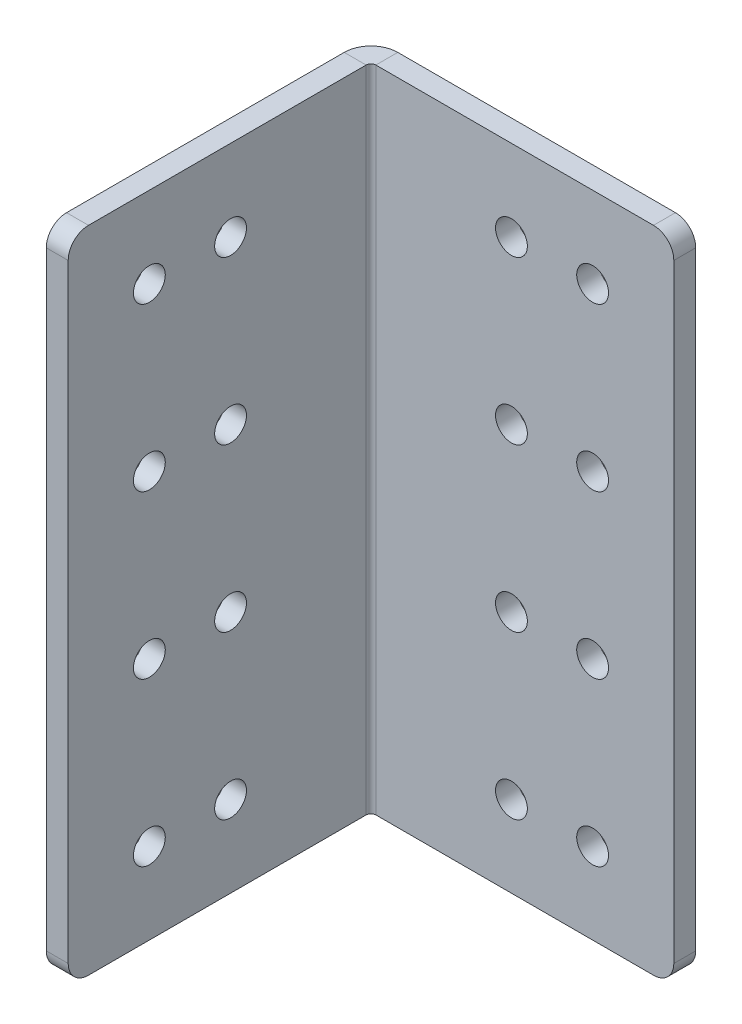
ISO-10303-21;
HEADER;
FILE_DESCRIPTION(('STEP AP214'),'2;1');
FILE_NAME('part.step','',(''),(''),'','','');
FILE_SCHEMA(('AUTOMOTIVE_DESIGN { 1 0 10303 214 1 1 1 1 }'));
ENDSEC;
DATA;
#1=APPLICATION_CONTEXT('core data for automotive mechanical design processes');
#2=APPLICATION_PROTOCOL_DEFINITION('international standard','automotive_design',2000,#1);
#3=PRODUCT_CONTEXT('',#1,'mechanical');
#4=PRODUCT('Part','Part','',(#3));
#5=PRODUCT_RELATED_PRODUCT_CATEGORY('part','',(#4));
#6=PRODUCT_DEFINITION_FORMATION('','',#4);
#7=PRODUCT_DEFINITION_CONTEXT('part definition',#1,'design');
#8=PRODUCT_DEFINITION('design','',#6,#7);
#9=PRODUCT_DEFINITION_SHAPE('','',#8);
#10=(LENGTH_UNIT() NAMED_UNIT(*) SI_UNIT(.MILLI.,.METRE.));
#11=(NAMED_UNIT(*) PLANE_ANGLE_UNIT() SI_UNIT($,.RADIAN.));
#12=(NAMED_UNIT(*) SI_UNIT($,.STERADIAN.) SOLID_ANGLE_UNIT());
#13=UNCERTAINTY_MEASURE_WITH_UNIT(LENGTH_MEASURE(1.E-05),#10,'distance_accuracy_value','');
#14=(GEOMETRIC_REPRESENTATION_CONTEXT(3) GLOBAL_UNCERTAINTY_ASSIGNED_CONTEXT((#13)) GLOBAL_UNIT_ASSIGNED_CONTEXT((#10,
#11,#12)) REPRESENTATION_CONTEXT('',''));
#15=CARTESIAN_POINT('',(0.,0.,0.));
#16=DIRECTION('',(0.,0.,1.));
#17=DIRECTION('',(1.,0.,0.));
#18=AXIS2_PLACEMENT_3D('',#15,#16,#17);
#19=CARTESIAN_POINT('',(4.191,50.8,0.));
#20=DIRECTION('',(0.,1.,0.));
#21=DIRECTION('',(0.,0.,1.));
#22=AXIS2_PLACEMENT_3D('',#19,#20,#21);
#23=PLANE('',#22);
#24=DIRECTION('',(0.,0.,1.));
#25=VECTOR('',#24,1.);
#26=CARTESIAN_POINT('',(4.191,50.8,0.));
#27=LINE('',#26,#25);
#28=CARTESIAN_POINT('',(4.191,50.8,0.));
#29=VERTEX_POINT('',#28);
#30=CARTESIAN_POINT('',(4.191,50.8,3.429));
#31=VERTEX_POINT('',#30);
#32=EDGE_CURVE('E128',#29,#31,#27,.T.);
#33=ORIENTED_EDGE('',*,*,#32,.F.);
#34=CARTESIAN_POINT('',(4.191,50.8,4.191));
#35=DIRECTION('',(0.,1.,0.));
#36=DIRECTION('',(0.,0.,1.));
#37=AXIS2_PLACEMENT_3D('',#34,#35,#36);
#38=CIRCLE('',#37,4.191);
#39=CARTESIAN_POINT('',(0.,50.8,4.191));
#40=VERTEX_POINT('',#39);
#41=EDGE_CURVE('E132',#40,#29,#38,.F.);
#42=ORIENTED_EDGE('',*,*,#41,.F.);
#43=DIRECTION('',(-1.,0.,0.));
#44=VECTOR('',#43,1.);
#45=CARTESIAN_POINT('',(3.429,50.8,4.191));
#46=LINE('',#45,#44);
#47=CARTESIAN_POINT('',(3.429,50.8,4.191));
#48=VERTEX_POINT('',#47);
#49=EDGE_CURVE('E137',#48,#40,#46,.T.);
#50=ORIENTED_EDGE('',*,*,#49,.F.);
#51=CARTESIAN_POINT('',(4.191,50.8,4.191));
#52=DIRECTION('',(0.,1.,0.));
#53=DIRECTION('',(1.,0.,0.));
#54=AXIS2_PLACEMENT_3D('',#51,#52,#53);
#55=CIRCLE('',#54,0.762);
#56=EDGE_CURVE('E134',#48,#31,#55,.F.);
#57=ORIENTED_EDGE('',*,*,#56,.T.);
#58=EDGE_LOOP('',(#33,#42,#50,#57));
#59=FACE_BOUND('',#58,.T.);
#60=ADVANCED_FACE('F37',(#59),#23,.T.);
#61=CARTESIAN_POINT('',(3.429,50.8,4.191));
#62=DIRECTION('',(0.,1.,0.));
#63=DIRECTION('',(0.,0.,1.));
#64=AXIS2_PLACEMENT_3D('',#61,#62,#63);
#65=PLANE('',#64);
#66=DIRECTION('',(1.,0.,0.));
#67=VECTOR('',#66,1.);
#68=CARTESIAN_POINT('',(0.,50.8,3.429));
#69=LINE('',#68,#67);
#70=CARTESIAN_POINT('',(47.625,50.8,3.429));
#71=VERTEX_POINT('',#70);
#72=EDGE_CURVE('E155',#31,#71,#69,.T.);
#73=ORIENTED_EDGE('',*,*,#72,.T.);
#74=DIRECTION('',(0.,0.,1.));
#75=VECTOR('',#74,1.);
#76=CARTESIAN_POINT('',(47.625,50.8,4.191));
#77=LINE('',#76,#75);
#78=CARTESIAN_POINT('',(47.625,50.8,0.));
#79=VERTEX_POINT('',#78);
#80=EDGE_CURVE('E45',#71,#79,#77,.F.);
#81=ORIENTED_EDGE('',*,*,#80,.T.);
#82=DIRECTION('',(1.,0.,0.));
#83=VECTOR('',#82,1.);
#84=CARTESIAN_POINT('',(0.,50.8,0.));
#85=LINE('',#84,#83);
#86=EDGE_CURVE('E144',#29,#79,#85,.T.);
#87=ORIENTED_EDGE('',*,*,#86,.F.);
#88=ORIENTED_EDGE('',*,*,#32,.T.);
#89=EDGE_LOOP('',(#73,#81,#87,#88));
#90=FACE_BOUND('',#89,.T.);
#91=ADVANCED_FACE('F154',(#90),#65,.T.);
#92=CARTESIAN_POINT('',(0.,-50.8,4.191));
#93=DIRECTION('',(0.,-1.,0.));
#94=DIRECTION('',(0.,0.,-1.));
#95=AXIS2_PLACEMENT_3D('',#92,#93,#94);
#96=PLANE('',#95);
#97=DIRECTION('',(1.,0.,0.));
#98=VECTOR('',#97,1.);
#99=CARTESIAN_POINT('',(0.,-50.8,4.191));
#100=LINE('',#99,#98);
#101=CARTESIAN_POINT('',(0.,-50.8,4.191));
#102=VERTEX_POINT('',#101);
#103=CARTESIAN_POINT('',(3.429,-50.8,4.191));
#104=VERTEX_POINT('',#103);
#105=EDGE_CURVE('E200',#102,#104,#100,.T.);
#106=ORIENTED_EDGE('',*,*,#105,.F.);
#107=CARTESIAN_POINT('',(4.191,-50.8,4.191));
#108=DIRECTION('',(0.,1.,0.));
#109=DIRECTION('',(0.,0.,1.));
#110=AXIS2_PLACEMENT_3D('',#107,#108,#109);
#111=CIRCLE('',#110,4.191);
#112=CARTESIAN_POINT('',(4.191,-50.8,0.));
#113=VERTEX_POINT('',#112);
#114=EDGE_CURVE('E174',#102,#113,#111,.F.);
#115=ORIENTED_EDGE('',*,*,#114,.T.);
#116=DIRECTION('',(0.,0.,-1.));
#117=VECTOR('',#116,1.);
#118=CARTESIAN_POINT('',(4.191,-50.8,3.429));
#119=LINE('',#118,#117);
#120=CARTESIAN_POINT('',(4.191,-50.8,3.429));
#121=VERTEX_POINT('',#120);
#122=EDGE_CURVE('E198',#121,#113,#119,.T.);
#123=ORIENTED_EDGE('',*,*,#122,.F.);
#124=CARTESIAN_POINT('',(4.191,-50.8,4.191));
#125=DIRECTION('',(0.,1.,0.));
#126=DIRECTION('',(1.,0.,0.));
#127=AXIS2_PLACEMENT_3D('',#124,#125,#126);
#128=CIRCLE('',#127,0.762);
#129=EDGE_CURVE('E180',#104,#121,#128,.F.);
#130=ORIENTED_EDGE('',*,*,#129,.F.);
#131=EDGE_LOOP('',(#106,#115,#123,#130));
#132=FACE_BOUND('',#131,.T.);
#133=ADVANCED_FACE('F390',(#132),#96,.T.);
#134=CARTESIAN_POINT('',(4.191,-50.8,3.429));
#135=DIRECTION('',(0.,-1.,0.));
#136=DIRECTION('',(0.,0.,-1.));
#137=AXIS2_PLACEMENT_3D('',#134,#135,#136);
#138=PLANE('',#137);
#139=DIRECTION('',(0.,0.,-1.));
#140=VECTOR('',#139,1.);
#141=CARTESIAN_POINT('',(3.429,-50.8,0.));
#142=LINE('',#141,#140);
#143=CARTESIAN_POINT('',(3.429,-50.8,47.625));
#144=VERTEX_POINT('',#143);
#145=EDGE_CURVE('E178',#144,#104,#142,.T.);
#146=ORIENTED_EDGE('',*,*,#145,.F.);
#147=DIRECTION('',(-1.,0.,0.));
#148=VECTOR('',#147,1.);
#149=CARTESIAN_POINT('',(4.191,-50.8,47.625));
#150=LINE('',#149,#148);
#151=CARTESIAN_POINT('',(0.,-50.8,47.625));
#152=VERTEX_POINT('',#151);
#153=EDGE_CURVE('E136',#144,#152,#150,.T.);
#154=ORIENTED_EDGE('',*,*,#153,.T.);
#155=DIRECTION('',(0.,0.,-1.));
#156=VECTOR('',#155,1.);
#157=CARTESIAN_POINT('',(0.,-50.8,0.));
#158=LINE('',#157,#156);
#159=EDGE_CURVE('E176',#152,#102,#158,.T.);
#160=ORIENTED_EDGE('',*,*,#159,.T.);
#161=ORIENTED_EDGE('',*,*,#105,.T.);
#162=EDGE_LOOP('',(#146,#154,#160,#161));
#163=FACE_BOUND('',#162,.T.);
#164=ADVANCED_FACE('F358',(#163),#138,.T.);
#165=CARTESIAN_POINT('',(0.,50.8,3.429));
#166=DIRECTION('',(0.,0.,-1.));
#167=DIRECTION('',(-1.,0.,0.));
#168=AXIS2_PLACEMENT_3D('',#165,#166,#167);
#169=PLANE('',#168);
#170=CARTESIAN_POINT('',(25.4000000000005,-12.7,3.429));
#171=DIRECTION('',(0.,0.,1.));
#172=DIRECTION('',(1.,0.,0.));
#173=AXIS2_PLACEMENT_3D('',#170,#171,#172);
#174=CIRCLE('',#173,2.4892);
#175=CARTESIAN_POINT('',(27.8892000000005,-12.7,3.429));
#176=VERTEX_POINT('',#175);
#177=EDGE_CURVE('E316',#176,#176,#174,.T.);
#178=ORIENTED_EDGE('',*,*,#177,.F.);
#179=EDGE_LOOP('',(#178));
#180=FACE_BOUND('',#179,.T.);
#181=CARTESIAN_POINT('',(38.1000000000003,12.7,3.429));
#182=DIRECTION('',(0.,0.,1.));
#183=DIRECTION('',(1.,0.,0.));
#184=AXIS2_PLACEMENT_3D('',#181,#182,#183);
#185=CIRCLE('',#184,2.4892);
#186=CARTESIAN_POINT('',(40.5892000000003,12.7,3.429));
#187=VERTEX_POINT('',#186);
#188=EDGE_CURVE('E323',#187,#187,#185,.T.);
#189=ORIENTED_EDGE('',*,*,#188,.F.);
#190=EDGE_LOOP('',(#189));
#191=FACE_BOUND('',#190,.T.);
#192=CARTESIAN_POINT('',(25.4000000000003,12.7,3.429));
#193=DIRECTION('',(0.,0.,1.));
#194=DIRECTION('',(1.,0.,0.));
#195=AXIS2_PLACEMENT_3D('',#192,#193,#194);
#196=CIRCLE('',#195,2.4892);
#197=CARTESIAN_POINT('',(27.8892000000003,12.7,3.429));
#198=VERTEX_POINT('',#197);
#199=EDGE_CURVE('E304',#198,#198,#196,.T.);
#200=ORIENTED_EDGE('',*,*,#199,.F.);
#201=EDGE_LOOP('',(#200));
#202=FACE_BOUND('',#201,.T.);
#203=CARTESIAN_POINT('',(38.1,38.1,3.429));
#204=DIRECTION('',(0.,0.,1.));
#205=DIRECTION('',(1.,0.,0.));
#206=AXIS2_PLACEMENT_3D('',#203,#204,#205);
#207=CIRCLE('',#206,2.4892);
#208=CARTESIAN_POINT('',(40.5892,38.1,3.429));
#209=VERTEX_POINT('',#208);
#210=EDGE_CURVE('E311',#209,#209,#207,.T.);
#211=ORIENTED_EDGE('',*,*,#210,.F.);
#212=EDGE_LOOP('',(#211));
#213=FACE_BOUND('',#212,.T.);
#214=CARTESIAN_POINT('',(38.1000000000008,-38.1,3.429));
#215=DIRECTION('',(0.,0.,1.));
#216=DIRECTION('',(1.,0.,0.));
#217=AXIS2_PLACEMENT_3D('',#214,#215,#216);
#218=CIRCLE('',#217,2.4892);
#219=CARTESIAN_POINT('',(40.5892000000008,-38.1,3.429));
#220=VERTEX_POINT('',#219);
#221=EDGE_CURVE('E340',#220,#220,#218,.T.);
#222=ORIENTED_EDGE('',*,*,#221,.F.);
#223=EDGE_LOOP('',(#222));
#224=FACE_BOUND('',#223,.T.);
#225=CARTESIAN_POINT('',(25.4000000000008,-38.1,3.429));
#226=DIRECTION('',(0.,0.,1.));
#227=DIRECTION('',(1.,0.,0.));
#228=AXIS2_PLACEMENT_3D('',#225,#226,#227);
#229=CIRCLE('',#228,2.4892);
#230=CARTESIAN_POINT('',(27.8892000000008,-38.1,3.429));
#231=VERTEX_POINT('',#230);
#232=EDGE_CURVE('E328',#231,#231,#229,.T.);
#233=ORIENTED_EDGE('',*,*,#232,.F.);
#234=EDGE_LOOP('',(#233));
#235=FACE_BOUND('',#234,.T.);
#236=CARTESIAN_POINT('',(38.1000000000005,-12.7,3.429));
#237=DIRECTION('',(0.,0.,1.));
#238=DIRECTION('',(1.,0.,0.));
#239=AXIS2_PLACEMENT_3D('',#236,#237,#238);
#240=CIRCLE('',#239,2.4892);
#241=CARTESIAN_POINT('',(40.5892000000005,-12.7,3.429));
#242=VERTEX_POINT('',#241);
#243=EDGE_CURVE('E335',#242,#242,#240,.T.);
#244=ORIENTED_EDGE('',*,*,#243,.F.);
#245=EDGE_LOOP('',(#244));
#246=FACE_BOUND('',#245,.T.);
#247=CARTESIAN_POINT('',(25.4,38.1,3.429));
#248=DIRECTION('',(0.,0.,1.));
#249=DIRECTION('',(1.,0.,0.));
#250=AXIS2_PLACEMENT_3D('',#247,#248,#249);
#251=CIRCLE('',#250,2.4892);
#252=CARTESIAN_POINT('',(27.8892,38.1,3.429));
#253=VERTEX_POINT('',#252);
#254=EDGE_CURVE('E298',#253,#253,#251,.T.);
#255=ORIENTED_EDGE('',*,*,#254,.F.);
#256=EDGE_LOOP('',(#255));
#257=FACE_BOUND('',#256,.T.);
#258=DIRECTION('',(1.,0.,0.));
#259=VECTOR('',#258,1.);
#260=CARTESIAN_POINT('',(0.,-50.8,3.429));
#261=LINE('',#260,#259);
#262=CARTESIAN_POINT('',(47.625,-50.8,3.429));
#263=VERTEX_POINT('',#262);
#264=EDGE_CURVE('E169',#121,#263,#261,.T.);
#265=ORIENTED_EDGE('',*,*,#264,.T.);
#266=CARTESIAN_POINT('',(47.625,-47.625,3.429));
#267=DIRECTION('',(0.,0.,-1.));
#268=DIRECTION('',(-1.,0.,0.));
#269=AXIS2_PLACEMENT_3D('',#266,#267,#268);
#270=CIRCLE('',#269,3.175);
#271=CARTESIAN_POINT('',(50.8,-47.625,3.429));
#272=VERTEX_POINT('',#271);
#273=EDGE_CURVE('E225',#263,#272,#270,.F.);
#274=ORIENTED_EDGE('',*,*,#273,.T.);
#275=DIRECTION('',(0.,-1.,0.));
#276=VECTOR('',#275,1.);
#277=CARTESIAN_POINT('',(50.8,50.8,3.429));
#278=LINE('',#277,#276);
#279=CARTESIAN_POINT('',(50.8,47.625,3.429));
#280=VERTEX_POINT('',#279);
#281=EDGE_CURVE('E196',#280,#272,#278,.T.);
#282=ORIENTED_EDGE('',*,*,#281,.F.);
#283=CARTESIAN_POINT('',(47.625,47.625,3.429));
#284=DIRECTION('',(0.,0.,-1.));
#285=DIRECTION('',(-1.,0.,0.));
#286=AXIS2_PLACEMENT_3D('',#283,#284,#285);
#287=CIRCLE('',#286,3.175);
#288=EDGE_CURVE('E223',#280,#71,#287,.F.);
#289=ORIENTED_EDGE('',*,*,#288,.T.);
#290=ORIENTED_EDGE('',*,*,#72,.F.);
#291=DIRECTION('',(0.,-1.,0.));
#292=VECTOR('',#291,1.);
#293=CARTESIAN_POINT('',(4.191,50.8,3.429));
#294=LINE('',#293,#292);
#295=EDGE_CURVE('E168',#31,#121,#294,.T.);
#296=ORIENTED_EDGE('',*,*,#295,.T.);
#297=EDGE_LOOP('',(#265,#274,#282,#289,#290,#296));
#298=FACE_BOUND('',#297,.T.);
#299=ADVANCED_FACE('F243',(#180,#191,#202,#213,#224,#235,#246,#257,#298),#169,.F.);
#300=CARTESIAN_POINT('',(50.8,50.8,0.));
#301=DIRECTION('',(1.,0.,0.));
#302=DIRECTION('',(0.,0.,-1.));
#303=AXIS2_PLACEMENT_3D('',#300,#301,#302);
#304=PLANE('',#303);
#305=ORIENTED_EDGE('',*,*,#281,.T.);
#306=DIRECTION('',(0.,0.,1.));
#307=VECTOR('',#306,1.);
#308=CARTESIAN_POINT('',(50.8,-47.625,0.));
#309=LINE('',#308,#307);
#310=CARTESIAN_POINT('',(50.8,-47.625,0.));
#311=VERTEX_POINT('',#310);
#312=EDGE_CURVE('E59',#272,#311,#309,.F.);
#313=ORIENTED_EDGE('',*,*,#312,.T.);
#314=DIRECTION('',(0.,-1.,0.));
#315=VECTOR('',#314,1.);
#316=CARTESIAN_POINT('',(50.8,50.8,0.));
#317=LINE('',#316,#315);
#318=CARTESIAN_POINT('',(50.8,47.625,0.));
#319=VERTEX_POINT('',#318);
#320=EDGE_CURVE('E151',#319,#311,#317,.T.);
#321=ORIENTED_EDGE('',*,*,#320,.F.);
#322=DIRECTION('',(0.,0.,1.));
#323=VECTOR('',#322,1.);
#324=CARTESIAN_POINT('',(50.8,47.625,0.));
#325=LINE('',#324,#323);
#326=EDGE_CURVE('E227',#319,#280,#325,.T.);
#327=ORIENTED_EDGE('',*,*,#326,.T.);
#328=EDGE_LOOP('',(#305,#313,#321,#327));
#329=FACE_BOUND('',#328,.T.);
#330=ADVANCED_FACE('F244',(#329),#304,.T.);
#331=CARTESIAN_POINT('',(0.,50.8,0.));
#332=DIRECTION('',(0.,0.,-1.));
#333=DIRECTION('',(-1.,0.,0.));
#334=AXIS2_PLACEMENT_3D('',#331,#332,#333);
#335=PLANE('',#334);
#336=CARTESIAN_POINT('',(25.4000000000005,-12.7,0.));
#337=DIRECTION('',(0.,0.,1.));
#338=DIRECTION('',(1.,0.,0.));
#339=AXIS2_PLACEMENT_3D('',#336,#337,#338);
#340=CIRCLE('',#339,2.4892);
#341=CARTESIAN_POINT('',(27.8892000000005,-12.7,0.));
#342=VERTEX_POINT('',#341);
#343=EDGE_CURVE('E319',#342,#342,#340,.T.);
#344=ORIENTED_EDGE('',*,*,#343,.T.);
#345=EDGE_LOOP('',(#344));
#346=FACE_BOUND('',#345,.T.);
#347=CARTESIAN_POINT('',(38.1000000000003,12.7,0.));
#348=DIRECTION('',(0.,0.,1.));
#349=DIRECTION('',(1.,0.,0.));
#350=AXIS2_PLACEMENT_3D('',#347,#348,#349);
#351=CIRCLE('',#350,2.4892);
#352=CARTESIAN_POINT('',(40.5892000000003,12.7,0.));
#353=VERTEX_POINT('',#352);
#354=EDGE_CURVE('E308',#353,#353,#351,.T.);
#355=ORIENTED_EDGE('',*,*,#354,.T.);
#356=EDGE_LOOP('',(#355));
#357=FACE_BOUND('',#356,.T.);
#358=CARTESIAN_POINT('',(25.4000000000003,12.7,0.));
#359=DIRECTION('',(0.,0.,1.));
#360=DIRECTION('',(1.,0.,0.));
#361=AXIS2_PLACEMENT_3D('',#358,#359,#360);
#362=CIRCLE('',#361,2.4892);
#363=CARTESIAN_POINT('',(27.8892000000003,12.7,0.));
#364=VERTEX_POINT('',#363);
#365=EDGE_CURVE('E307',#364,#364,#362,.T.);
#366=ORIENTED_EDGE('',*,*,#365,.T.);
#367=EDGE_LOOP('',(#366));
#368=FACE_BOUND('',#367,.T.);
#369=CARTESIAN_POINT('',(38.1,38.1,0.));
#370=DIRECTION('',(0.,0.,1.));
#371=DIRECTION('',(1.,0.,0.));
#372=AXIS2_PLACEMENT_3D('',#369,#370,#371);
#373=CIRCLE('',#372,2.4892);
#374=CARTESIAN_POINT('',(40.5892,38.1,0.));
#375=VERTEX_POINT('',#374);
#376=EDGE_CURVE('E301',#375,#375,#373,.T.);
#377=ORIENTED_EDGE('',*,*,#376,.T.);
#378=EDGE_LOOP('',(#377));
#379=FACE_BOUND('',#378,.T.);
#380=CARTESIAN_POINT('',(38.1000000000008,-38.1,0.));
#381=DIRECTION('',(0.,0.,1.));
#382=DIRECTION('',(1.,0.,0.));
#383=AXIS2_PLACEMENT_3D('',#380,#381,#382);
#384=CIRCLE('',#383,2.4892);
#385=CARTESIAN_POINT('',(40.5892000000008,-38.1,0.));
#386=VERTEX_POINT('',#385);
#387=EDGE_CURVE('E332',#386,#386,#384,.T.);
#388=ORIENTED_EDGE('',*,*,#387,.T.);
#389=EDGE_LOOP('',(#388));
#390=FACE_BOUND('',#389,.T.);
#391=CARTESIAN_POINT('',(25.4000000000008,-38.1,0.));
#392=DIRECTION('',(0.,0.,1.));
#393=DIRECTION('',(1.,0.,0.));
#394=AXIS2_PLACEMENT_3D('',#391,#392,#393);
#395=CIRCLE('',#394,2.4892);
#396=CARTESIAN_POINT('',(27.8892000000008,-38.1,0.));
#397=VERTEX_POINT('',#396);
#398=EDGE_CURVE('E331',#397,#397,#395,.T.);
#399=ORIENTED_EDGE('',*,*,#398,.T.);
#400=EDGE_LOOP('',(#399));
#401=FACE_BOUND('',#400,.T.);
#402=CARTESIAN_POINT('',(38.1000000000005,-12.7,0.));
#403=DIRECTION('',(0.,0.,1.));
#404=DIRECTION('',(1.,0.,0.));
#405=AXIS2_PLACEMENT_3D('',#402,#403,#404);
#406=CIRCLE('',#405,2.4892);
#407=CARTESIAN_POINT('',(40.5892000000005,-12.7,0.));
#408=VERTEX_POINT('',#407);
#409=EDGE_CURVE('E320',#408,#408,#406,.T.);
#410=ORIENTED_EDGE('',*,*,#409,.T.);
#411=EDGE_LOOP('',(#410));
#412=FACE_BOUND('',#411,.T.);
#413=CARTESIAN_POINT('',(25.4,38.1,0.));
#414=DIRECTION('',(0.,0.,1.));
#415=DIRECTION('',(1.,0.,0.));
#416=AXIS2_PLACEMENT_3D('',#413,#414,#415);
#417=CIRCLE('',#416,2.4892);
#418=CARTESIAN_POINT('',(27.8892,38.1,0.));
#419=VERTEX_POINT('',#418);
#420=EDGE_CURVE('E295',#419,#419,#417,.T.);
#421=ORIENTED_EDGE('',*,*,#420,.T.);
#422=EDGE_LOOP('',(#421));
#423=FACE_BOUND('',#422,.T.);
#424=ORIENTED_EDGE('',*,*,#320,.T.);
#425=CARTESIAN_POINT('',(47.625,-47.625,0.));
#426=DIRECTION('',(0.,0.,-1.));
#427=DIRECTION('',(-1.,0.,0.));
#428=AXIS2_PLACEMENT_3D('',#425,#426,#427);
#429=CIRCLE('',#428,3.175);
#430=CARTESIAN_POINT('',(47.625,-50.8,0.));
#431=VERTEX_POINT('',#430);
#432=EDGE_CURVE('E233',#311,#431,#429,.T.);
#433=ORIENTED_EDGE('',*,*,#432,.T.);
#434=DIRECTION('',(1.,0.,0.));
#435=VECTOR('',#434,1.);
#436=CARTESIAN_POINT('',(0.,-50.8,0.));
#437=LINE('',#436,#435);
#438=EDGE_CURVE('E147',#113,#431,#437,.T.);
#439=ORIENTED_EDGE('',*,*,#438,.F.);
#440=DIRECTION('',(0.,-1.,0.));
#441=VECTOR('',#440,1.);
#442=CARTESIAN_POINT('',(4.191,50.8,0.));
#443=LINE('',#442,#441);
#444=EDGE_CURVE('E142',#29,#113,#443,.T.);
#445=ORIENTED_EDGE('',*,*,#444,.F.);
#446=ORIENTED_EDGE('',*,*,#86,.T.);
#447=CARTESIAN_POINT('',(47.625,47.625,0.));
#448=DIRECTION('',(0.,0.,-1.));
#449=DIRECTION('',(-1.,0.,0.));
#450=AXIS2_PLACEMENT_3D('',#447,#448,#449);
#451=CIRCLE('',#450,3.175);
#452=EDGE_CURVE('E231',#79,#319,#451,.T.);
#453=ORIENTED_EDGE('',*,*,#452,.T.);
#454=EDGE_LOOP('',(#424,#433,#439,#445,#446,#453));
#455=FACE_BOUND('',#454,.T.);
#456=ADVANCED_FACE('F143',(#346,#357,#368,#379,#390,#401,#412,#423,#455),#335,.T.);
#457=CARTESIAN_POINT('',(4.191,50.8,4.191));
#458=DIRECTION('',(0.,-1.,0.));
#459=DIRECTION('',(0.,0.,-1.));
#460=AXIS2_PLACEMENT_3D('',#457,#458,#459);
#461=CYLINDRICAL_SURFACE('',#460,4.191);
#462=ORIENTED_EDGE('',*,*,#114,.F.);
#463=DIRECTION('',(0.,-1.,0.));
#464=VECTOR('',#463,1.);
#465=CARTESIAN_POINT('',(0.,50.8,4.191));
#466=LINE('',#465,#464);
#467=EDGE_CURVE('E152',#40,#102,#466,.T.);
#468=ORIENTED_EDGE('',*,*,#467,.F.);
#469=ORIENTED_EDGE('',*,*,#41,.T.);
#470=ORIENTED_EDGE('',*,*,#444,.T.);
#471=EDGE_LOOP('',(#462,#468,#469,#470));
#472=FACE_BOUND('',#471,.T.);
#473=ADVANCED_FACE('F158',(#472),#461,.T.);
#474=CARTESIAN_POINT('',(0.,50.8,0.));
#475=DIRECTION('',(-1.,0.,0.));
#476=DIRECTION('',(0.,0.,1.));
#477=AXIS2_PLACEMENT_3D('',#474,#475,#476);
#478=PLANE('',#477);
#479=CARTESIAN_POINT('',(0.,-12.7,38.0999999999995));
#480=DIRECTION('',(1.,0.,0.));
#481=DIRECTION('',(0.,0.,-1.));
#482=AXIS2_PLACEMENT_3D('',#479,#480,#481);
#483=CIRCLE('',#482,2.4892);
#484=CARTESIAN_POINT('',(0.,-12.7,35.6107999999995));
#485=VERTEX_POINT('',#484);
#486=EDGE_CURVE('E271',#485,#485,#483,.T.);
#487=ORIENTED_EDGE('',*,*,#486,.T.);
#488=EDGE_LOOP('',(#487));
#489=FACE_BOUND('',#488,.T.);
#490=CARTESIAN_POINT('',(0.,12.7,25.3999999999997));
#491=DIRECTION('',(1.,0.,0.));
#492=DIRECTION('',(0.,0.,-1.));
#493=AXIS2_PLACEMENT_3D('',#490,#491,#492);
#494=CIRCLE('',#493,2.4892);
#495=CARTESIAN_POINT('',(0.,12.7,22.9107999999997));
#496=VERTEX_POINT('',#495);
#497=EDGE_CURVE('E260',#496,#496,#494,.T.);
#498=ORIENTED_EDGE('',*,*,#497,.T.);
#499=EDGE_LOOP('',(#498));
#500=FACE_BOUND('',#499,.T.);
#501=CARTESIAN_POINT('',(0.,12.7,38.0999999999997));
#502=DIRECTION('',(1.,0.,0.));
#503=DIRECTION('',(0.,0.,-1.));
#504=AXIS2_PLACEMENT_3D('',#501,#502,#503);
#505=CIRCLE('',#504,2.4892);
#506=CARTESIAN_POINT('',(0.,12.7,35.6107999999997));
#507=VERTEX_POINT('',#506);
#508=EDGE_CURVE('E259',#507,#507,#505,.T.);
#509=ORIENTED_EDGE('',*,*,#508,.T.);
#510=EDGE_LOOP('',(#509));
#511=FACE_BOUND('',#510,.T.);
#512=CARTESIAN_POINT('',(0.,38.1,25.4));
#513=DIRECTION('',(1.,0.,0.));
#514=DIRECTION('',(0.,0.,-1.));
#515=AXIS2_PLACEMENT_3D('',#512,#513,#514);
#516=CIRCLE('',#515,2.4892);
#517=CARTESIAN_POINT('',(0.,38.1,22.9108));
#518=VERTEX_POINT('',#517);
#519=EDGE_CURVE('E253',#518,#518,#516,.T.);
#520=ORIENTED_EDGE('',*,*,#519,.T.);
#521=EDGE_LOOP('',(#520));
#522=FACE_BOUND('',#521,.T.);
#523=CARTESIAN_POINT('',(0.,-38.1,25.3999999999992));
#524=DIRECTION('',(1.,0.,0.));
#525=DIRECTION('',(0.,0.,-1.));
#526=AXIS2_PLACEMENT_3D('',#523,#524,#525);
#527=CIRCLE('',#526,2.4892);
#528=CARTESIAN_POINT('',(0.,-38.1,22.9107999999992));
#529=VERTEX_POINT('',#528);
#530=EDGE_CURVE('E284',#529,#529,#527,.T.);
#531=ORIENTED_EDGE('',*,*,#530,.T.);
#532=EDGE_LOOP('',(#531));
#533=FACE_BOUND('',#532,.T.);
#534=CARTESIAN_POINT('',(0.,-38.1,38.0999999999992));
#535=DIRECTION('',(1.,0.,0.));
#536=DIRECTION('',(0.,0.,-1.));
#537=AXIS2_PLACEMENT_3D('',#534,#535,#536);
#538=CIRCLE('',#537,2.4892);
#539=CARTESIAN_POINT('',(0.,-38.1,35.6107999999992));
#540=VERTEX_POINT('',#539);
#541=EDGE_CURVE('E283',#540,#540,#538,.T.);
#542=ORIENTED_EDGE('',*,*,#541,.T.);
#543=EDGE_LOOP('',(#542));
#544=FACE_BOUND('',#543,.T.);
#545=CARTESIAN_POINT('',(0.,-12.7,25.3999999999995));
#546=DIRECTION('',(1.,0.,0.));
#547=DIRECTION('',(0.,0.,-1.));
#548=AXIS2_PLACEMENT_3D('',#545,#546,#547);
#549=CIRCLE('',#548,2.4892);
#550=CARTESIAN_POINT('',(0.,-12.7,22.9107999999995));
#551=VERTEX_POINT('',#550);
#552=EDGE_CURVE('E272',#551,#551,#549,.T.);
#553=ORIENTED_EDGE('',*,*,#552,.T.);
#554=EDGE_LOOP('',(#553));
#555=FACE_BOUND('',#554,.T.);
#556=CARTESIAN_POINT('',(0.,38.1,38.1));
#557=DIRECTION('',(1.,0.,0.));
#558=DIRECTION('',(0.,0.,-1.));
#559=AXIS2_PLACEMENT_3D('',#556,#557,#558);
#560=CIRCLE('',#559,2.4892);
#561=CARTESIAN_POINT('',(0.,38.1,35.6108));
#562=VERTEX_POINT('',#561);
#563=EDGE_CURVE('E172',#562,#562,#560,.T.);
#564=ORIENTED_EDGE('',*,*,#563,.T.);
#565=EDGE_LOOP('',(#564));
#566=FACE_BOUND('',#565,.T.);
#567=ORIENTED_EDGE('',*,*,#159,.F.);
#568=CARTESIAN_POINT('',(0.,-47.625,47.625));
#569=DIRECTION('',(-1.,0.,0.));
#570=DIRECTION('',(0.,0.,1.));
#571=AXIS2_PLACEMENT_3D('',#568,#569,#570);
#572=CIRCLE('',#571,3.175);
#573=CARTESIAN_POINT('',(0.,-47.625,50.8));
#574=VERTEX_POINT('',#573);
#575=EDGE_CURVE('E209',#152,#574,#572,.T.);
#576=ORIENTED_EDGE('',*,*,#575,.T.);
#577=DIRECTION('',(0.,-1.,0.));
#578=VECTOR('',#577,1.);
#579=CARTESIAN_POINT('',(0.,50.8,50.8));
#580=LINE('',#579,#578);
#581=CARTESIAN_POINT('',(0.,47.625,50.8));
#582=VERTEX_POINT('',#581);
#583=EDGE_CURVE('E191',#582,#574,#580,.T.);
#584=ORIENTED_EDGE('',*,*,#583,.F.);
#585=CARTESIAN_POINT('',(0.,47.625,47.625));
#586=DIRECTION('',(-1.,0.,0.));
#587=DIRECTION('',(0.,0.,1.));
#588=AXIS2_PLACEMENT_3D('',#585,#586,#587);
#589=CIRCLE('',#588,3.175);
#590=CARTESIAN_POINT('',(0.,50.8,47.625));
#591=VERTEX_POINT('',#590);
#592=EDGE_CURVE('E207',#582,#591,#589,.T.);
#593=ORIENTED_EDGE('',*,*,#592,.T.);
#594=DIRECTION('',(0.,0.,-1.));
#595=VECTOR('',#594,1.);
#596=CARTESIAN_POINT('',(0.,50.8,0.));
#597=LINE('',#596,#595);
#598=EDGE_CURVE('E160',#591,#40,#597,.T.);
#599=ORIENTED_EDGE('',*,*,#598,.T.);
#600=ORIENTED_EDGE('',*,*,#467,.T.);
#601=EDGE_LOOP('',(#567,#576,#584,#593,#599,#600));
#602=FACE_BOUND('',#601,.T.);
#603=ADVANCED_FACE('F442',(#489,#500,#511,#522,#533,#544,#555,#566,#602),#478,.T.);
#604=CARTESIAN_POINT('',(3.429,50.8,50.8));
#605=DIRECTION('',(0.,0.,1.));
#606=DIRECTION('',(1.,0.,0.));
#607=AXIS2_PLACEMENT_3D('',#604,#605,#606);
#608=PLANE('',#607);
#609=ORIENTED_EDGE('',*,*,#583,.T.);
#610=DIRECTION('',(-1.,0.,0.));
#611=VECTOR('',#610,1.);
#612=CARTESIAN_POINT('',(3.429,-47.625,50.8));
#613=LINE('',#612,#611);
#614=CARTESIAN_POINT('',(3.429,-47.625,50.8));
#615=VERTEX_POINT('',#614);
#616=EDGE_CURVE('E214',#574,#615,#613,.F.);
#617=ORIENTED_EDGE('',*,*,#616,.T.);
#618=DIRECTION('',(0.,-1.,0.));
#619=VECTOR('',#618,1.);
#620=CARTESIAN_POINT('',(3.429,50.8,50.8));
#621=LINE('',#620,#619);
#622=CARTESIAN_POINT('',(3.429,47.625,50.8));
#623=VERTEX_POINT('',#622);
#624=EDGE_CURVE('E188',#623,#615,#621,.T.);
#625=ORIENTED_EDGE('',*,*,#624,.F.);
#626=DIRECTION('',(-1.,0.,0.));
#627=VECTOR('',#626,1.);
#628=CARTESIAN_POINT('',(3.429,47.625,50.8));
#629=LINE('',#628,#627);
#630=EDGE_CURVE('E211',#623,#582,#629,.T.);
#631=ORIENTED_EDGE('',*,*,#630,.T.);
#632=EDGE_LOOP('',(#609,#617,#625,#631));
#633=FACE_BOUND('',#632,.T.);
#634=ADVANCED_FACE('F417',(#633),#608,.T.);
#635=CARTESIAN_POINT('',(3.429,50.8,0.));
#636=DIRECTION('',(-1.,0.,0.));
#637=DIRECTION('',(0.,0.,1.));
#638=AXIS2_PLACEMENT_3D('',#635,#636,#637);
#639=PLANE('',#638);
#640=CARTESIAN_POINT('',(3.429,-12.7,38.0999999999995));
#641=DIRECTION('',(1.,0.,0.));
#642=DIRECTION('',(0.,0.,-1.));
#643=AXIS2_PLACEMENT_3D('',#640,#641,#642);
#644=CIRCLE('',#643,2.4892);
#645=CARTESIAN_POINT('',(3.429,-12.7,35.6107999999995));
#646=VERTEX_POINT('',#645);
#647=EDGE_CURVE('E268',#646,#646,#644,.T.);
#648=ORIENTED_EDGE('',*,*,#647,.F.);
#649=EDGE_LOOP('',(#648));
#650=FACE_BOUND('',#649,.T.);
#651=CARTESIAN_POINT('',(3.429,12.7,25.3999999999997));
#652=DIRECTION('',(1.,0.,0.));
#653=DIRECTION('',(0.,0.,-1.));
#654=AXIS2_PLACEMENT_3D('',#651,#652,#653);
#655=CIRCLE('',#654,2.4892);
#656=CARTESIAN_POINT('',(3.429,12.7,22.9107999999997));
#657=VERTEX_POINT('',#656);
#658=EDGE_CURVE('E275',#657,#657,#655,.T.);
#659=ORIENTED_EDGE('',*,*,#658,.F.);
#660=EDGE_LOOP('',(#659));
#661=FACE_BOUND('',#660,.T.);
#662=CARTESIAN_POINT('',(3.429,12.7,38.0999999999997));
#663=DIRECTION('',(1.,0.,0.));
#664=DIRECTION('',(0.,0.,-1.));
#665=AXIS2_PLACEMENT_3D('',#662,#663,#664);
#666=CIRCLE('',#665,2.4892);
#667=CARTESIAN_POINT('',(3.429,12.7,35.6107999999997));
#668=VERTEX_POINT('',#667);
#669=EDGE_CURVE('E256',#668,#668,#666,.T.);
#670=ORIENTED_EDGE('',*,*,#669,.F.);
#671=EDGE_LOOP('',(#670));
#672=FACE_BOUND('',#671,.T.);
#673=CARTESIAN_POINT('',(3.429,38.1,25.4));
#674=DIRECTION('',(1.,0.,0.));
#675=DIRECTION('',(0.,0.,-1.));
#676=AXIS2_PLACEMENT_3D('',#673,#674,#675);
#677=CIRCLE('',#676,2.4892);
#678=CARTESIAN_POINT('',(3.429,38.1,22.9108));
#679=VERTEX_POINT('',#678);
#680=EDGE_CURVE('E263',#679,#679,#677,.T.);
#681=ORIENTED_EDGE('',*,*,#680,.F.);
#682=EDGE_LOOP('',(#681));
#683=FACE_BOUND('',#682,.T.);
#684=CARTESIAN_POINT('',(3.429,-38.1,25.3999999999992));
#685=DIRECTION('',(1.,0.,0.));
#686=DIRECTION('',(0.,0.,-1.));
#687=AXIS2_PLACEMENT_3D('',#684,#685,#686);
#688=CIRCLE('',#687,2.4892);
#689=CARTESIAN_POINT('',(3.429,-38.1,22.9107999999992));
#690=VERTEX_POINT('',#689);
#691=EDGE_CURVE('E292',#690,#690,#688,.T.);
#692=ORIENTED_EDGE('',*,*,#691,.F.);
#693=EDGE_LOOP('',(#692));
#694=FACE_BOUND('',#693,.T.);
#695=CARTESIAN_POINT('',(3.429,-38.1,38.0999999999992));
#696=DIRECTION('',(1.,0.,0.));
#697=DIRECTION('',(0.,0.,-1.));
#698=AXIS2_PLACEMENT_3D('',#695,#696,#697);
#699=CIRCLE('',#698,2.4892);
#700=CARTESIAN_POINT('',(3.429,-38.1,35.6107999999992));
#701=VERTEX_POINT('',#700);
#702=EDGE_CURVE('E280',#701,#701,#699,.T.);
#703=ORIENTED_EDGE('',*,*,#702,.F.);
#704=EDGE_LOOP('',(#703));
#705=FACE_BOUND('',#704,.T.);
#706=CARTESIAN_POINT('',(3.429,-12.7,25.3999999999995));
#707=DIRECTION('',(1.,0.,0.));
#708=DIRECTION('',(0.,0.,-1.));
#709=AXIS2_PLACEMENT_3D('',#706,#707,#708);
#710=CIRCLE('',#709,2.4892);
#711=CARTESIAN_POINT('',(3.429,-12.7,22.9107999999995));
#712=VERTEX_POINT('',#711);
#713=EDGE_CURVE('E287',#712,#712,#710,.T.);
#714=ORIENTED_EDGE('',*,*,#713,.F.);
#715=EDGE_LOOP('',(#714));
#716=FACE_BOUND('',#715,.T.);
#717=CARTESIAN_POINT('',(3.429,38.1,38.1));
#718=DIRECTION('',(1.,0.,0.));
#719=DIRECTION('',(0.,0.,-1.));
#720=AXIS2_PLACEMENT_3D('',#717,#718,#719);
#721=CIRCLE('',#720,2.4892);
#722=CARTESIAN_POINT('',(3.429,38.1,35.6108));
#723=VERTEX_POINT('',#722);
#724=EDGE_CURVE('E250',#723,#723,#721,.T.);
#725=ORIENTED_EDGE('',*,*,#724,.F.);
#726=EDGE_LOOP('',(#725));
#727=FACE_BOUND('',#726,.T.);
#728=ORIENTED_EDGE('',*,*,#624,.T.);
#729=CARTESIAN_POINT('',(3.429,-47.625,47.625));
#730=DIRECTION('',(-1.,0.,0.));
#731=DIRECTION('',(0.,0.,1.));
#732=AXIS2_PLACEMENT_3D('',#729,#730,#731);
#733=CIRCLE('',#732,3.175);
#734=EDGE_CURVE('E218',#615,#144,#733,.F.);
#735=ORIENTED_EDGE('',*,*,#734,.T.);
#736=ORIENTED_EDGE('',*,*,#145,.T.);
#737=DIRECTION('',(0.,-1.,0.));
#738=VECTOR('',#737,1.);
#739=CARTESIAN_POINT('',(3.429,50.8,4.191));
#740=LINE('',#739,#738);
#741=EDGE_CURVE('E185',#48,#104,#740,.T.);
#742=ORIENTED_EDGE('',*,*,#741,.F.);
#743=DIRECTION('',(0.,0.,-1.));
#744=VECTOR('',#743,1.);
#745=CARTESIAN_POINT('',(3.429,50.8,0.));
#746=LINE('',#745,#744);
#747=CARTESIAN_POINT('',(3.429,50.8,47.625));
#748=VERTEX_POINT('',#747);
#749=EDGE_CURVE('E162',#748,#48,#746,.T.);
#750=ORIENTED_EDGE('',*,*,#749,.F.);
#751=CARTESIAN_POINT('',(3.429,47.625,47.625));
#752=DIRECTION('',(-1.,0.,0.));
#753=DIRECTION('',(0.,0.,1.));
#754=AXIS2_PLACEMENT_3D('',#751,#752,#753);
#755=CIRCLE('',#754,3.175);
#756=EDGE_CURVE('E216',#748,#623,#755,.F.);
#757=ORIENTED_EDGE('',*,*,#756,.T.);
#758=EDGE_LOOP('',(#728,#735,#736,#742,#750,#757));
#759=FACE_BOUND('',#758,.T.);
#760=ADVANCED_FACE('F413',(#650,#661,#672,#683,#694,#705,#716,#727,#759),#639,.F.);
#761=CARTESIAN_POINT('',(4.191,50.8,4.191));
#762=DIRECTION('',(0.,-1.,0.));
#763=DIRECTION('',(0.,0.,-1.));
#764=AXIS2_PLACEMENT_3D('',#761,#762,#763);
#765=CYLINDRICAL_SURFACE('',#764,0.762);
#766=ORIENTED_EDGE('',*,*,#129,.T.);
#767=ORIENTED_EDGE('',*,*,#295,.F.);
#768=ORIENTED_EDGE('',*,*,#56,.F.);
#769=ORIENTED_EDGE('',*,*,#741,.T.);
#770=EDGE_LOOP('',(#766,#767,#768,#769));
#771=FACE_BOUND('',#770,.T.);
#772=ADVANCED_FACE('F428',(#771),#765,.F.);
#773=CARTESIAN_POINT('',(4.191,50.8,4.191));
#774=DIRECTION('',(0.,1.,0.));
#775=DIRECTION('',(1.,0.,0.));
#776=AXIS2_PLACEMENT_3D('',#773,#774,#775);
#777=PLANE('',#776);
#778=ORIENTED_EDGE('',*,*,#598,.F.);
#779=DIRECTION('',(-1.,0.,0.));
#780=VECTOR('',#779,1.);
#781=CARTESIAN_POINT('',(4.191,50.8,47.625));
#782=LINE('',#781,#780);
#783=EDGE_CURVE('E11',#591,#748,#782,.F.);
#784=ORIENTED_EDGE('',*,*,#783,.T.);
#785=ORIENTED_EDGE('',*,*,#749,.T.);
#786=ORIENTED_EDGE('',*,*,#49,.T.);
#787=EDGE_LOOP('',(#778,#784,#785,#786));
#788=FACE_BOUND('',#787,.T.);
#789=ADVANCED_FACE('F453',(#788),#777,.T.);
#790=CARTESIAN_POINT('',(4.191,-50.8,4.191));
#791=DIRECTION('',(0.,1.,0.));
#792=DIRECTION('',(1.,0.,0.));
#793=AXIS2_PLACEMENT_3D('',#790,#791,#792);
#794=PLANE('',#793);
#795=ORIENTED_EDGE('',*,*,#438,.T.);
#796=DIRECTION('',(0.,0.,1.));
#797=VECTOR('',#796,1.);
#798=CARTESIAN_POINT('',(47.625,-50.8,3.429));
#799=LINE('',#798,#797);
#800=EDGE_CURVE('E220',#431,#263,#799,.T.);
#801=ORIENTED_EDGE('',*,*,#800,.T.);
#802=ORIENTED_EDGE('',*,*,#264,.F.);
#803=ORIENTED_EDGE('',*,*,#122,.T.);
#804=EDGE_LOOP('',(#795,#801,#802,#803));
#805=FACE_BOUND('',#804,.T.);
#806=ADVANCED_FACE('F238',(#805),#794,.F.);
#807=CARTESIAN_POINT('',(0.,38.1,38.1));
#808=DIRECTION('',(1.,0.,0.));
#809=DIRECTION('',(0.,0.,-1.));
#810=AXIS2_PLACEMENT_3D('',#807,#808,#809);
#811=CYLINDRICAL_SURFACE('',#810,2.4892);
#812=ORIENTED_EDGE('',*,*,#563,.F.);
#813=EDGE_LOOP('',(#812));
#814=FACE_BOUND('',#813,.T.);
#815=ORIENTED_EDGE('',*,*,#724,.T.);
#816=EDGE_LOOP('',(#815));
#817=FACE_BOUND('',#816,.T.);
#818=ADVANCED_FACE('F456',(#814,#817),#811,.F.);
#819=CARTESIAN_POINT('',(0.,-12.7,25.3999999999995));
#820=DIRECTION('',(1.,0.,0.));
#821=DIRECTION('',(0.,0.,-1.));
#822=AXIS2_PLACEMENT_3D('',#819,#820,#821);
#823=CYLINDRICAL_SURFACE('',#822,2.4892);
#824=ORIENTED_EDGE('',*,*,#552,.F.);
#825=EDGE_LOOP('',(#824));
#826=FACE_BOUND('',#825,.T.);
#827=ORIENTED_EDGE('',*,*,#713,.T.);
#828=EDGE_LOOP('',(#827));
#829=FACE_BOUND('',#828,.T.);
#830=ADVANCED_FACE('F462',(#826,#829),#823,.F.);
#831=CARTESIAN_POINT('',(0.,-38.1,38.0999999999992));
#832=DIRECTION('',(1.,0.,0.));
#833=DIRECTION('',(0.,0.,-1.));
#834=AXIS2_PLACEMENT_3D('',#831,#832,#833);
#835=CYLINDRICAL_SURFACE('',#834,2.4892);
#836=ORIENTED_EDGE('',*,*,#541,.F.);
#837=EDGE_LOOP('',(#836));
#838=FACE_BOUND('',#837,.T.);
#839=ORIENTED_EDGE('',*,*,#702,.T.);
#840=EDGE_LOOP('',(#839));
#841=FACE_BOUND('',#840,.T.);
#842=ADVANCED_FACE('F476',(#838,#841),#835,.F.);
#843=CARTESIAN_POINT('',(0.,-38.1,25.3999999999992));
#844=DIRECTION('',(1.,0.,0.));
#845=DIRECTION('',(0.,0.,-1.));
#846=AXIS2_PLACEMENT_3D('',#843,#844,#845);
#847=CYLINDRICAL_SURFACE('',#846,2.4892);
#848=ORIENTED_EDGE('',*,*,#530,.F.);
#849=EDGE_LOOP('',(#848));
#850=FACE_BOUND('',#849,.T.);
#851=ORIENTED_EDGE('',*,*,#691,.T.);
#852=EDGE_LOOP('',(#851));
#853=FACE_BOUND('',#852,.T.);
#854=ADVANCED_FACE('F470',(#850,#853),#847,.F.);
#855=CARTESIAN_POINT('',(0.,38.1,25.4));
#856=DIRECTION('',(1.,0.,0.));
#857=DIRECTION('',(0.,0.,-1.));
#858=AXIS2_PLACEMENT_3D('',#855,#856,#857);
#859=CYLINDRICAL_SURFACE('',#858,2.4892);
#860=ORIENTED_EDGE('',*,*,#519,.F.);
#861=EDGE_LOOP('',(#860));
#862=FACE_BOUND('',#861,.T.);
#863=ORIENTED_EDGE('',*,*,#680,.T.);
#864=EDGE_LOOP('',(#863));
#865=FACE_BOUND('',#864,.T.);
#866=ADVANCED_FACE('F467',(#862,#865),#859,.F.);
#867=CARTESIAN_POINT('',(0.,12.7,38.0999999999997));
#868=DIRECTION('',(1.,0.,0.));
#869=DIRECTION('',(0.,0.,-1.));
#870=AXIS2_PLACEMENT_3D('',#867,#868,#869);
#871=CYLINDRICAL_SURFACE('',#870,2.4892);
#872=ORIENTED_EDGE('',*,*,#508,.F.);
#873=EDGE_LOOP('',(#872));
#874=FACE_BOUND('',#873,.T.);
#875=ORIENTED_EDGE('',*,*,#669,.T.);
#876=EDGE_LOOP('',(#875));
#877=FACE_BOUND('',#876,.T.);
#878=ADVANCED_FACE('F464',(#874,#877),#871,.F.);
#879=CARTESIAN_POINT('',(0.,12.7,25.3999999999997));
#880=DIRECTION('',(1.,0.,0.));
#881=DIRECTION('',(0.,0.,-1.));
#882=AXIS2_PLACEMENT_3D('',#879,#880,#881);
#883=CYLINDRICAL_SURFACE('',#882,2.4892);
#884=ORIENTED_EDGE('',*,*,#497,.F.);
#885=EDGE_LOOP('',(#884));
#886=FACE_BOUND('',#885,.T.);
#887=ORIENTED_EDGE('',*,*,#658,.T.);
#888=EDGE_LOOP('',(#887));
#889=FACE_BOUND('',#888,.T.);
#890=ADVANCED_FACE('F379',(#886,#889),#883,.F.);
#891=CARTESIAN_POINT('',(0.,-12.7,38.0999999999995));
#892=DIRECTION('',(1.,0.,0.));
#893=DIRECTION('',(0.,0.,-1.));
#894=AXIS2_PLACEMENT_3D('',#891,#892,#893);
#895=CYLINDRICAL_SURFACE('',#894,2.4892);
#896=ORIENTED_EDGE('',*,*,#486,.F.);
#897=EDGE_LOOP('',(#896));
#898=FACE_BOUND('',#897,.T.);
#899=ORIENTED_EDGE('',*,*,#647,.T.);
#900=EDGE_LOOP('',(#899));
#901=FACE_BOUND('',#900,.T.);
#902=ADVANCED_FACE('F370',(#898,#901),#895,.F.);
#903=CARTESIAN_POINT('',(25.4,38.1,0.));
#904=DIRECTION('',(0.,0.,1.));
#905=DIRECTION('',(1.,0.,0.));
#906=AXIS2_PLACEMENT_3D('',#903,#904,#905);
#907=CYLINDRICAL_SURFACE('',#906,2.4892);
#908=ORIENTED_EDGE('',*,*,#420,.F.);
#909=EDGE_LOOP('',(#908));
#910=FACE_BOUND('',#909,.T.);
#911=ORIENTED_EDGE('',*,*,#254,.T.);
#912=EDGE_LOOP('',(#911));
#913=FACE_BOUND('',#912,.T.);
#914=ADVANCED_FACE('F367',(#910,#913),#907,.F.);
#915=CARTESIAN_POINT('',(38.1000000000005,-12.7,0.));
#916=DIRECTION('',(0.,0.,1.));
#917=DIRECTION('',(1.,0.,0.));
#918=AXIS2_PLACEMENT_3D('',#915,#916,#917);
#919=CYLINDRICAL_SURFACE('',#918,2.4892);
#920=ORIENTED_EDGE('',*,*,#409,.F.);
#921=EDGE_LOOP('',(#920));
#922=FACE_BOUND('',#921,.T.);
#923=ORIENTED_EDGE('',*,*,#243,.T.);
#924=EDGE_LOOP('',(#923));
#925=FACE_BOUND('',#924,.T.);
#926=ADVANCED_FACE('F369',(#922,#925),#919,.F.);
#927=CARTESIAN_POINT('',(25.4000000000008,-38.1,0.));
#928=DIRECTION('',(0.,0.,1.));
#929=DIRECTION('',(1.,0.,0.));
#930=AXIS2_PLACEMENT_3D('',#927,#928,#929);
#931=CYLINDRICAL_SURFACE('',#930,2.4892);
#932=ORIENTED_EDGE('',*,*,#398,.F.);
#933=EDGE_LOOP('',(#932));
#934=FACE_BOUND('',#933,.T.);
#935=ORIENTED_EDGE('',*,*,#232,.T.);
#936=EDGE_LOOP('',(#935));
#937=FACE_BOUND('',#936,.T.);
#938=ADVANCED_FACE('F352',(#934,#937),#931,.F.);
#939=CARTESIAN_POINT('',(38.1000000000008,-38.1,0.));
#940=DIRECTION('',(0.,0.,1.));
#941=DIRECTION('',(1.,0.,0.));
#942=AXIS2_PLACEMENT_3D('',#939,#940,#941);
#943=CYLINDRICAL_SURFACE('',#942,2.4892);
#944=ORIENTED_EDGE('',*,*,#387,.F.);
#945=EDGE_LOOP('',(#944));
#946=FACE_BOUND('',#945,.T.);
#947=ORIENTED_EDGE('',*,*,#221,.T.);
#948=EDGE_LOOP('',(#947));
#949=FACE_BOUND('',#948,.T.);
#950=ADVANCED_FACE('F348',(#946,#949),#943,.F.);
#951=CARTESIAN_POINT('',(38.1,38.1,0.));
#952=DIRECTION('',(0.,0.,1.));
#953=DIRECTION('',(1.,0.,0.));
#954=AXIS2_PLACEMENT_3D('',#951,#952,#953);
#955=CYLINDRICAL_SURFACE('',#954,2.4892);
#956=ORIENTED_EDGE('',*,*,#376,.F.);
#957=EDGE_LOOP('',(#956));
#958=FACE_BOUND('',#957,.T.);
#959=ORIENTED_EDGE('',*,*,#210,.T.);
#960=EDGE_LOOP('',(#959));
#961=FACE_BOUND('',#960,.T.);
#962=ADVANCED_FACE('F351',(#958,#961),#955,.F.);
#963=CARTESIAN_POINT('',(25.4000000000003,12.7,0.));
#964=DIRECTION('',(0.,0.,1.));
#965=DIRECTION('',(1.,0.,0.));
#966=AXIS2_PLACEMENT_3D('',#963,#964,#965);
#967=CYLINDRICAL_SURFACE('',#966,2.4892);
#968=ORIENTED_EDGE('',*,*,#365,.F.);
#969=EDGE_LOOP('',(#968));
#970=FACE_BOUND('',#969,.T.);
#971=ORIENTED_EDGE('',*,*,#199,.T.);
#972=EDGE_LOOP('',(#971));
#973=FACE_BOUND('',#972,.T.);
#974=ADVANCED_FACE('F565',(#970,#973),#967,.F.);
#975=CARTESIAN_POINT('',(38.1000000000003,12.7,0.));
#976=DIRECTION('',(0.,0.,1.));
#977=DIRECTION('',(1.,0.,0.));
#978=AXIS2_PLACEMENT_3D('',#975,#976,#977);
#979=CYLINDRICAL_SURFACE('',#978,2.4892);
#980=ORIENTED_EDGE('',*,*,#354,.F.);
#981=EDGE_LOOP('',(#980));
#982=FACE_BOUND('',#981,.T.);
#983=ORIENTED_EDGE('',*,*,#188,.T.);
#984=EDGE_LOOP('',(#983));
#985=FACE_BOUND('',#984,.T.);
#986=ADVANCED_FACE('F576',(#982,#985),#979,.F.);
#987=CARTESIAN_POINT('',(25.4000000000005,-12.7,0.));
#988=DIRECTION('',(0.,0.,1.));
#989=DIRECTION('',(1.,0.,0.));
#990=AXIS2_PLACEMENT_3D('',#987,#988,#989);
#991=CYLINDRICAL_SURFACE('',#990,2.4892);
#992=ORIENTED_EDGE('',*,*,#343,.F.);
#993=EDGE_LOOP('',(#992));
#994=FACE_BOUND('',#993,.T.);
#995=ORIENTED_EDGE('',*,*,#177,.T.);
#996=EDGE_LOOP('',(#995));
#997=FACE_BOUND('',#996,.T.);
#998=ADVANCED_FACE('F397',(#994,#997),#991,.F.);
#999=CARTESIAN_POINT('',(4.191,-47.625,47.625));
#1000=DIRECTION('',(-1.,0.,0.));
#1001=DIRECTION('',(0.,0.,1.));
#1002=AXIS2_PLACEMENT_3D('',#999,#1000,#1001);
#1003=CYLINDRICAL_SURFACE('',#1002,3.175);
#1004=ORIENTED_EDGE('',*,*,#734,.F.);
#1005=ORIENTED_EDGE('',*,*,#616,.F.);
#1006=ORIENTED_EDGE('',*,*,#575,.F.);
#1007=ORIENTED_EDGE('',*,*,#153,.F.);
#1008=EDGE_LOOP('',(#1004,#1005,#1006,#1007));
#1009=FACE_BOUND('',#1008,.T.);
#1010=ADVANCED_FACE('F394',(#1009),#1003,.T.);
#1011=CARTESIAN_POINT('',(47.625,-47.625,4.191));
#1012=DIRECTION('',(0.,0.,-1.));
#1013=DIRECTION('',(-1.,0.,0.));
#1014=AXIS2_PLACEMENT_3D('',#1011,#1012,#1013);
#1015=CYLINDRICAL_SURFACE('',#1014,3.175);
#1016=ORIENTED_EDGE('',*,*,#432,.F.);
#1017=ORIENTED_EDGE('',*,*,#312,.F.);
#1018=ORIENTED_EDGE('',*,*,#273,.F.);
#1019=ORIENTED_EDGE('',*,*,#800,.F.);
#1020=EDGE_LOOP('',(#1016,#1017,#1018,#1019));
#1021=FACE_BOUND('',#1020,.T.);
#1022=ADVANCED_FACE('F240',(#1021),#1015,.T.);
#1023=CARTESIAN_POINT('',(47.625,47.625,0.));
#1024=DIRECTION('',(0.,0.,1.));
#1025=DIRECTION('',(1.,0.,0.));
#1026=AXIS2_PLACEMENT_3D('',#1023,#1024,#1025);
#1027=CYLINDRICAL_SURFACE('',#1026,3.175);
#1028=ORIENTED_EDGE('',*,*,#452,.F.);
#1029=ORIENTED_EDGE('',*,*,#80,.F.);
#1030=ORIENTED_EDGE('',*,*,#288,.F.);
#1031=ORIENTED_EDGE('',*,*,#326,.F.);
#1032=EDGE_LOOP('',(#1028,#1029,#1030,#1031));
#1033=FACE_BOUND('',#1032,.T.);
#1034=ADVANCED_FACE('F247',(#1033),#1027,.T.);
#1035=CARTESIAN_POINT('',(3.429,47.625,47.625));
#1036=DIRECTION('',(-1.,0.,0.));
#1037=DIRECTION('',(0.,0.,1.));
#1038=AXIS2_PLACEMENT_3D('',#1035,#1036,#1037);
#1039=CYLINDRICAL_SURFACE('',#1038,3.175);
#1040=ORIENTED_EDGE('',*,*,#756,.F.);
#1041=ORIENTED_EDGE('',*,*,#783,.F.);
#1042=ORIENTED_EDGE('',*,*,#592,.F.);
#1043=ORIENTED_EDGE('',*,*,#630,.F.);
#1044=EDGE_LOOP('',(#1040,#1041,#1042,#1043));
#1045=FACE_BOUND('',#1044,.T.);
#1046=ADVANCED_FACE('F39',(#1045),#1039,.T.);
#1047=CLOSED_SHELL('',(#60,#91,#133,#164,#299,#330,#456,#473,#603,#634,#760,#772,#789,#806,#818,
#830,#842,#854,#866,#878,#890,#902,#914,#926,#938,#950,#962,#974,#986,#998,#1010,#1022,#1034,#1046));
#1048=MANIFOLD_SOLID_BREP('B2',#1047);
#1049=ADVANCED_BREP_SHAPE_REPRESENTATION('',(#18,#1048),#14);
#1050=SHAPE_DEFINITION_REPRESENTATION(#9,#1049);
ENDSEC;
END-ISO-10303-21;
